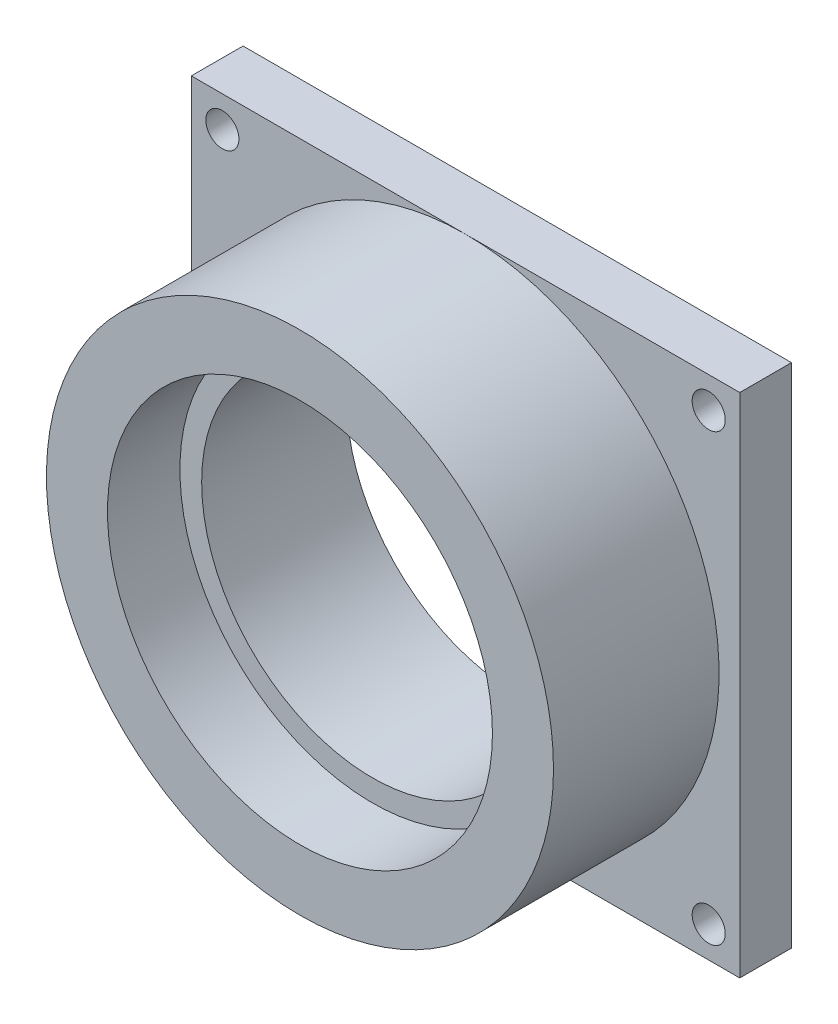
ISO-10303-21;
HEADER;
FILE_DESCRIPTION(('STEP AP214'),'2;1');
FILE_NAME('part.step','',(''),(''),'','','');
FILE_SCHEMA(('AUTOMOTIVE_DESIGN { 1 0 10303 214 1 1 1 1 }'));
ENDSEC;
DATA;
#1=APPLICATION_CONTEXT('core data for automotive mechanical design processes');
#2=APPLICATION_PROTOCOL_DEFINITION('international standard','automotive_design',2000,#1);
#3=PRODUCT_CONTEXT('',#1,'mechanical');
#4=PRODUCT('Part','Part','',(#3));
#5=PRODUCT_RELATED_PRODUCT_CATEGORY('part','',(#4));
#6=PRODUCT_DEFINITION_FORMATION('','',#4);
#7=PRODUCT_DEFINITION_CONTEXT('part definition',#1,'design');
#8=PRODUCT_DEFINITION('design','',#6,#7);
#9=PRODUCT_DEFINITION_SHAPE('','',#8);
#10=(LENGTH_UNIT() NAMED_UNIT(*) SI_UNIT(.MILLI.,.METRE.));
#11=(NAMED_UNIT(*) PLANE_ANGLE_UNIT() SI_UNIT($,.RADIAN.));
#12=(NAMED_UNIT(*) SI_UNIT($,.STERADIAN.) SOLID_ANGLE_UNIT());
#13=UNCERTAINTY_MEASURE_WITH_UNIT(LENGTH_MEASURE(1.E-05),#10,'distance_accuracy_value','');
#14=(GEOMETRIC_REPRESENTATION_CONTEXT(3) GLOBAL_UNCERTAINTY_ASSIGNED_CONTEXT((#13)) GLOBAL_UNIT_ASSIGNED_CONTEXT((#10,
#11,#12)) REPRESENTATION_CONTEXT('',''));
#15=CARTESIAN_POINT('',(0.,0.,0.));
#16=DIRECTION('',(0.,0.,1.));
#17=DIRECTION('',(1.,0.,0.));
#18=AXIS2_PLACEMENT_3D('',#15,#16,#17);
#19=CARTESIAN_POINT('',(0.,0.,5.));
#20=DIRECTION('',(0.,0.,-1.));
#21=DIRECTION('',(-1.,0.,0.));
#22=AXIS2_PLACEMENT_3D('',#19,#20,#21);
#23=PLANE('',#22);
#24=CARTESIAN_POINT('',(-23.4999999999999,21.5,5.));
#25=DIRECTION('',(0.,0.,-1.));
#26=DIRECTION('',(-1.,0.,0.));
#27=AXIS2_PLACEMENT_3D('',#24,#25,#26);
#28=CIRCLE('',#27,1.6);
#29=CARTESIAN_POINT('',(-25.0999999999999,21.5,5.));
#30=VERTEX_POINT('',#29);
#31=EDGE_CURVE('E164',#30,#30,#28,.T.);
#32=ORIENTED_EDGE('',*,*,#31,.T.);
#33=EDGE_LOOP('',(#32));
#34=FACE_BOUND('',#33,.T.);
#35=CARTESIAN_POINT('',(-23.5,-21.5,5.));
#36=DIRECTION('',(0.,0.,-1.));
#37=DIRECTION('',(-1.,0.,0.));
#38=AXIS2_PLACEMENT_3D('',#35,#36,#37);
#39=CIRCLE('',#38,1.6);
#40=CARTESIAN_POINT('',(-25.1,-21.5,5.));
#41=VERTEX_POINT('',#40);
#42=EDGE_CURVE('E165',#41,#41,#39,.T.);
#43=ORIENTED_EDGE('',*,*,#42,.T.);
#44=EDGE_LOOP('',(#43));
#45=FACE_BOUND('',#44,.T.);
#46=CARTESIAN_POINT('',(0.,0.,5.));
#47=DIRECTION('',(0.,0.,1.));
#48=DIRECTION('',(1.,0.,0.));
#49=AXIS2_PLACEMENT_3D('',#46,#47,#48);
#50=CIRCLE('',#49,24.5);
#51=CARTESIAN_POINT('',(0.,24.5,5.));
#52=VERTEX_POINT('',#51);
#53=CARTESIAN_POINT('',(0.,-24.5,5.));
#54=VERTEX_POINT('',#53);
#55=EDGE_CURVE('E56',#52,#54,#50,.T.);
#56=ORIENTED_EDGE('',*,*,#55,.F.);
#57=DIRECTION('',(-1.,0.,0.));
#58=VECTOR('',#57,1.);
#59=CARTESIAN_POINT('',(-26.5,24.5,5.));
#60=LINE('',#59,#58);
#61=CARTESIAN_POINT('',(-26.5,24.5,5.));
#62=VERTEX_POINT('',#61);
#63=EDGE_CURVE('E104',#52,#62,#60,.T.);
#64=ORIENTED_EDGE('',*,*,#63,.T.);
#65=DIRECTION('',(0.,-1.,0.));
#66=VECTOR('',#65,1.);
#67=CARTESIAN_POINT('',(-26.5,-24.5,5.));
#68=LINE('',#67,#66);
#69=CARTESIAN_POINT('',(-26.5,-24.5,5.));
#70=VERTEX_POINT('',#69);
#71=EDGE_CURVE('E103',#62,#70,#68,.T.);
#72=ORIENTED_EDGE('',*,*,#71,.T.);
#73=DIRECTION('',(1.,0.,0.));
#74=VECTOR('',#73,1.);
#75=CARTESIAN_POINT('',(-26.5,-24.5,5.));
#76=LINE('',#75,#74);
#77=EDGE_CURVE('E117',#70,#54,#76,.T.);
#78=ORIENTED_EDGE('',*,*,#77,.T.);
#79=EDGE_LOOP('',(#56,#64,#72,#78));
#80=FACE_BOUND('',#79,.T.);
#81=ADVANCED_FACE('F45',(#34,#45,#80),#23,.F.);
#82=CARTESIAN_POINT('',(26.5,-24.5,5.));
#83=DIRECTION('',(-1.,0.,0.));
#84=DIRECTION('',(0.,0.,1.));
#85=AXIS2_PLACEMENT_3D('',#82,#83,#84);
#86=PLANE('',#85);
#87=DIRECTION('',(0.,1.,0.));
#88=VECTOR('',#87,1.);
#89=CARTESIAN_POINT('',(26.5,-24.5,0.));
#90=LINE('',#89,#88);
#91=CARTESIAN_POINT('',(26.5,-24.5,0.));
#92=VERTEX_POINT('',#91);
#93=CARTESIAN_POINT('',(26.5,24.5,0.));
#94=VERTEX_POINT('',#93);
#95=EDGE_CURVE('E179',#92,#94,#90,.T.);
#96=ORIENTED_EDGE('',*,*,#95,.T.);
#97=DIRECTION('',(0.,0.,-1.));
#98=VECTOR('',#97,1.);
#99=CARTESIAN_POINT('',(26.5,24.5,5.));
#100=LINE('',#99,#98);
#101=CARTESIAN_POINT('',(26.5,24.5,5.));
#102=VERTEX_POINT('',#101);
#103=EDGE_CURVE('E49',#102,#94,#100,.T.);
#104=ORIENTED_EDGE('',*,*,#103,.F.);
#105=DIRECTION('',(0.,1.,0.));
#106=VECTOR('',#105,1.);
#107=CARTESIAN_POINT('',(26.5,-24.5,5.));
#108=LINE('',#107,#106);
#109=CARTESIAN_POINT('',(26.5,-24.5,5.));
#110=VERTEX_POINT('',#109);
#111=EDGE_CURVE('E100',#110,#102,#108,.T.);
#112=ORIENTED_EDGE('',*,*,#111,.F.);
#113=DIRECTION('',(0.,0.,-1.));
#114=VECTOR('',#113,1.);
#115=CARTESIAN_POINT('',(26.5,-24.5,5.));
#116=LINE('',#115,#114);
#117=EDGE_CURVE('E187',#110,#92,#116,.T.);
#118=ORIENTED_EDGE('',*,*,#117,.T.);
#119=EDGE_LOOP('',(#96,#104,#112,#118));
#120=FACE_BOUND('',#119,.T.);
#121=ADVANCED_FACE('F47',(#120),#86,.F.);
#122=CARTESIAN_POINT('',(-26.5,24.5,5.));
#123=DIRECTION('',(0.,-1.,0.));
#124=DIRECTION('',(0.,0.,-1.));
#125=AXIS2_PLACEMENT_3D('',#122,#123,#124);
#126=PLANE('',#125);
#127=DIRECTION('',(-1.,0.,0.));
#128=VECTOR('',#127,1.);
#129=CARTESIAN_POINT('',(-26.5,24.5,0.));
#130=LINE('',#129,#128);
#131=CARTESIAN_POINT('',(-26.5,24.5,0.));
#132=VERTEX_POINT('',#131);
#133=EDGE_CURVE('E191',#94,#132,#130,.T.);
#134=ORIENTED_EDGE('',*,*,#133,.T.);
#135=DIRECTION('',(0.,0.,-1.));
#136=VECTOR('',#135,1.);
#137=CARTESIAN_POINT('',(-26.5,24.5,5.));
#138=LINE('',#137,#136);
#139=EDGE_CURVE('E110',#62,#132,#138,.T.);
#140=ORIENTED_EDGE('',*,*,#139,.F.);
#141=ORIENTED_EDGE('',*,*,#63,.F.);
#142=EDGE_CURVE('E95',#102,#52,#60,.T.);
#143=ORIENTED_EDGE('',*,*,#142,.F.);
#144=ORIENTED_EDGE('',*,*,#103,.T.);
#145=EDGE_LOOP('',(#134,#140,#141,#143,#144));
#146=FACE_BOUND('',#145,.T.);
#147=ADVANCED_FACE('F108',(#146),#126,.F.);
#148=CARTESIAN_POINT('',(-26.5,-24.5,5.));
#149=DIRECTION('',(1.,0.,0.));
#150=DIRECTION('',(0.,0.,-1.));
#151=AXIS2_PLACEMENT_3D('',#148,#149,#150);
#152=PLANE('',#151);
#153=DIRECTION('',(0.,-1.,0.));
#154=VECTOR('',#153,1.);
#155=CARTESIAN_POINT('',(-26.5,-24.5,0.));
#156=LINE('',#155,#154);
#157=CARTESIAN_POINT('',(-26.5,-24.5,0.));
#158=VERTEX_POINT('',#157);
#159=EDGE_CURVE('E194',#132,#158,#156,.T.);
#160=ORIENTED_EDGE('',*,*,#159,.T.);
#161=DIRECTION('',(0.,0.,-1.));
#162=VECTOR('',#161,1.);
#163=CARTESIAN_POINT('',(-26.5,-24.5,5.));
#164=LINE('',#163,#162);
#165=EDGE_CURVE('E201',#70,#158,#164,.T.);
#166=ORIENTED_EDGE('',*,*,#165,.F.);
#167=ORIENTED_EDGE('',*,*,#71,.F.);
#168=ORIENTED_EDGE('',*,*,#139,.T.);
#169=EDGE_LOOP('',(#160,#166,#167,#168));
#170=FACE_BOUND('',#169,.T.);
#171=ADVANCED_FACE('F154',(#170),#152,.F.);
#172=CARTESIAN_POINT('',(-26.5,-24.5,5.));
#173=DIRECTION('',(0.,1.,0.));
#174=DIRECTION('',(0.,0.,1.));
#175=AXIS2_PLACEMENT_3D('',#172,#173,#174);
#176=PLANE('',#175);
#177=DIRECTION('',(1.,0.,0.));
#178=VECTOR('',#177,1.);
#179=CARTESIAN_POINT('',(-26.5,-24.5,0.));
#180=LINE('',#179,#178);
#181=EDGE_CURVE('E88',#158,#92,#180,.T.);
#182=ORIENTED_EDGE('',*,*,#181,.T.);
#183=ORIENTED_EDGE('',*,*,#117,.F.);
#184=EDGE_CURVE('E66',#54,#110,#76,.T.);
#185=ORIENTED_EDGE('',*,*,#184,.F.);
#186=ORIENTED_EDGE('',*,*,#77,.F.);
#187=ORIENTED_EDGE('',*,*,#165,.T.);
#188=EDGE_LOOP('',(#182,#183,#185,#186,#187));
#189=FACE_BOUND('',#188,.T.);
#190=ADVANCED_FACE('F149',(#189),#176,.F.);
#191=CARTESIAN_POINT('',(23.5,-21.5000000000003,5.));
#192=DIRECTION('',(0.,0.,-1.));
#193=DIRECTION('',(-1.,0.,0.));
#194=AXIS2_PLACEMENT_3D('',#191,#192,#193);
#195=CIRCLE('',#194,1.6);
#196=CARTESIAN_POINT('',(21.9,-21.5000000000003,5.));
#197=VERTEX_POINT('',#196);
#198=EDGE_CURVE('E121',#197,#197,#195,.T.);
#199=ORIENTED_EDGE('',*,*,#198,.T.);
#200=EDGE_LOOP('',(#199));
#201=FACE_BOUND('',#200,.T.);
#202=CARTESIAN_POINT('',(23.5000000000001,21.4999999999997,5.));
#203=DIRECTION('',(0.,0.,-1.));
#204=DIRECTION('',(-1.,0.,0.));
#205=AXIS2_PLACEMENT_3D('',#202,#203,#204);
#206=CIRCLE('',#205,1.6);
#207=CARTESIAN_POINT('',(21.9000000000001,21.4999999999997,5.));
#208=VERTEX_POINT('',#207);
#209=EDGE_CURVE('E161',#208,#208,#206,.T.);
#210=ORIENTED_EDGE('',*,*,#209,.T.);
#211=EDGE_LOOP('',(#210));
#212=FACE_BOUND('',#211,.T.);
#213=EDGE_CURVE('E11',#54,#52,#50,.T.);
#214=ORIENTED_EDGE('',*,*,#213,.F.);
#215=ORIENTED_EDGE('',*,*,#184,.T.);
#216=ORIENTED_EDGE('',*,*,#111,.T.);
#217=ORIENTED_EDGE('',*,*,#142,.T.);
#218=EDGE_LOOP('',(#214,#215,#216,#217));
#219=FACE_BOUND('',#218,.T.);
#220=ADVANCED_FACE('F98',(#201,#212,#219),#23,.F.);
#221=CARTESIAN_POINT('',(0.,0.,0.));
#222=DIRECTION('',(0.,0.,-1.));
#223=DIRECTION('',(-1.,0.,0.));
#224=AXIS2_PLACEMENT_3D('',#221,#222,#223);
#225=PLANE('',#224);
#226=CARTESIAN_POINT('',(0.,0.,0.));
#227=DIRECTION('',(0.,0.,1.));
#228=DIRECTION('',(1.,0.,0.));
#229=AXIS2_PLACEMENT_3D('',#226,#227,#228);
#230=CIRCLE('',#229,16.5);
#231=CARTESIAN_POINT('',(16.5,0.,0.));
#232=VERTEX_POINT('',#231);
#233=EDGE_CURVE('E326',#232,#232,#230,.T.);
#234=ORIENTED_EDGE('',*,*,#233,.T.);
#235=EDGE_LOOP('',(#234));
#236=FACE_BOUND('',#235,.T.);
#237=CARTESIAN_POINT('',(23.5,-21.5000000000003,0.));
#238=DIRECTION('',(0.,0.,-1.));
#239=DIRECTION('',(-1.,0.,0.));
#240=AXIS2_PLACEMENT_3D('',#237,#238,#239);
#241=CIRCLE('',#240,1.6);
#242=CARTESIAN_POINT('',(21.9,-21.5000000000003,0.));
#243=VERTEX_POINT('',#242);
#244=EDGE_CURVE('E348',#243,#243,#241,.T.);
#245=ORIENTED_EDGE('',*,*,#244,.F.);
#246=EDGE_LOOP('',(#245));
#247=FACE_BOUND('',#246,.T.);
#248=CARTESIAN_POINT('',(-23.4999999999999,21.5,0.));
#249=DIRECTION('',(0.,0.,-1.));
#250=DIRECTION('',(-1.,0.,0.));
#251=AXIS2_PLACEMENT_3D('',#248,#249,#250);
#252=CIRCLE('',#251,1.6);
#253=CARTESIAN_POINT('',(-25.0999999999999,21.5,0.));
#254=VERTEX_POINT('',#253);
#255=EDGE_CURVE('E347',#254,#254,#252,.T.);
#256=ORIENTED_EDGE('',*,*,#255,.F.);
#257=EDGE_LOOP('',(#256));
#258=FACE_BOUND('',#257,.T.);
#259=CARTESIAN_POINT('',(23.5000000000001,21.4999999999997,0.));
#260=DIRECTION('',(0.,0.,-1.));
#261=DIRECTION('',(-1.,0.,0.));
#262=AXIS2_PLACEMENT_3D('',#259,#260,#261);
#263=CIRCLE('',#262,1.6);
#264=CARTESIAN_POINT('',(21.9000000000001,21.4999999999997,0.));
#265=VERTEX_POINT('',#264);
#266=EDGE_CURVE('E340',#265,#265,#263,.T.);
#267=ORIENTED_EDGE('',*,*,#266,.F.);
#268=EDGE_LOOP('',(#267));
#269=FACE_BOUND('',#268,.T.);
#270=CARTESIAN_POINT('',(-23.5,-21.5,0.));
#271=DIRECTION('',(0.,0.,-1.));
#272=DIRECTION('',(-1.,0.,0.));
#273=AXIS2_PLACEMENT_3D('',#270,#271,#272);
#274=CIRCLE('',#273,1.6);
#275=CARTESIAN_POINT('',(-25.1,-21.5,0.));
#276=VERTEX_POINT('',#275);
#277=EDGE_CURVE('E171',#276,#276,#274,.T.);
#278=ORIENTED_EDGE('',*,*,#277,.F.);
#279=EDGE_LOOP('',(#278));
#280=FACE_BOUND('',#279,.T.);
#281=ORIENTED_EDGE('',*,*,#95,.F.);
#282=ORIENTED_EDGE('',*,*,#181,.F.);
#283=ORIENTED_EDGE('',*,*,#159,.F.);
#284=ORIENTED_EDGE('',*,*,#133,.F.);
#285=EDGE_LOOP('',(#281,#282,#283,#284));
#286=FACE_BOUND('',#285,.T.);
#287=ADVANCED_FACE('F125',(#236,#247,#258,#269,#280,#286),#225,.T.);
#288=CARTESIAN_POINT('',(0.,0.,21.));
#289=DIRECTION('',(0.,0.,-1.));
#290=DIRECTION('',(-1.,0.,0.));
#291=AXIS2_PLACEMENT_3D('',#288,#289,#290);
#292=CYLINDRICAL_SURFACE('',#291,24.5);
#293=CARTESIAN_POINT('',(0.,0.,21.));
#294=DIRECTION('',(0.,0.,1.));
#295=DIRECTION('',(1.,0.,0.));
#296=AXIS2_PLACEMENT_3D('',#293,#294,#295);
#297=CIRCLE('',#296,24.5);
#298=CARTESIAN_POINT('',(24.5,0.,21.));
#299=VERTEX_POINT('',#298);
#300=EDGE_CURVE('E120',#299,#299,#297,.T.);
#301=ORIENTED_EDGE('',*,*,#300,.F.);
#302=EDGE_LOOP('',(#301));
#303=FACE_BOUND('',#302,.T.);
#304=ORIENTED_EDGE('',*,*,#55,.T.);
#305=ORIENTED_EDGE('',*,*,#213,.T.);
#306=EDGE_LOOP('',(#304,#305));
#307=FACE_BOUND('',#306,.T.);
#308=ADVANCED_FACE('F122',(#303,#307),#292,.T.);
#309=CARTESIAN_POINT('',(0.,0.,21.));
#310=DIRECTION('',(0.,0.,1.));
#311=DIRECTION('',(1.,0.,0.));
#312=AXIS2_PLACEMENT_3D('',#309,#310,#311);
#313=PLANE('',#312);
#314=CARTESIAN_POINT('',(0.,0.,21.));
#315=DIRECTION('',(0.,0.,1.));
#316=DIRECTION('',(1.,0.,0.));
#317=AXIS2_PLACEMENT_3D('',#314,#315,#316);
#318=CIRCLE('',#317,18.6);
#319=CARTESIAN_POINT('',(18.6,0.,21.));
#320=VERTEX_POINT('',#319);
#321=EDGE_CURVE('E333',#320,#320,#318,.T.);
#322=ORIENTED_EDGE('',*,*,#321,.F.);
#323=EDGE_LOOP('',(#322));
#324=FACE_BOUND('',#323,.T.);
#325=ORIENTED_EDGE('',*,*,#300,.T.);
#326=EDGE_LOOP('',(#325));
#327=FACE_BOUND('',#326,.T.);
#328=ADVANCED_FACE('F124',(#324,#327),#313,.T.);
#329=CARTESIAN_POINT('',(-23.5,-21.5,21.));
#330=DIRECTION('',(0.,0.,-1.));
#331=DIRECTION('',(-1.,0.,0.));
#332=AXIS2_PLACEMENT_3D('',#329,#330,#331);
#333=CYLINDRICAL_SURFACE('',#332,1.6);
#334=ORIENTED_EDGE('',*,*,#277,.T.);
#335=EDGE_LOOP('',(#334));
#336=FACE_BOUND('',#335,.T.);
#337=ORIENTED_EDGE('',*,*,#42,.F.);
#338=EDGE_LOOP('',(#337));
#339=FACE_BOUND('',#338,.T.);
#340=ADVANCED_FACE('F133',(#336,#339),#333,.F.);
#341=CARTESIAN_POINT('',(23.5000000000001,21.4999999999997,21.));
#342=DIRECTION('',(0.,0.,-1.));
#343=DIRECTION('',(-1.,0.,0.));
#344=AXIS2_PLACEMENT_3D('',#341,#342,#343);
#345=CYLINDRICAL_SURFACE('',#344,1.6);
#346=ORIENTED_EDGE('',*,*,#266,.T.);
#347=EDGE_LOOP('',(#346));
#348=FACE_BOUND('',#347,.T.);
#349=ORIENTED_EDGE('',*,*,#209,.F.);
#350=EDGE_LOOP('',(#349));
#351=FACE_BOUND('',#350,.T.);
#352=ADVANCED_FACE('F263',(#348,#351),#345,.F.);
#353=CARTESIAN_POINT('',(-23.4999999999999,21.5,21.));
#354=DIRECTION('',(0.,0.,-1.));
#355=DIRECTION('',(-1.,0.,0.));
#356=AXIS2_PLACEMENT_3D('',#353,#354,#355);
#357=CYLINDRICAL_SURFACE('',#356,1.6);
#358=ORIENTED_EDGE('',*,*,#255,.T.);
#359=EDGE_LOOP('',(#358));
#360=FACE_BOUND('',#359,.T.);
#361=ORIENTED_EDGE('',*,*,#31,.F.);
#362=EDGE_LOOP('',(#361));
#363=FACE_BOUND('',#362,.T.);
#364=ADVANCED_FACE('F273',(#360,#363),#357,.F.);
#365=CARTESIAN_POINT('',(23.5,-21.5000000000003,21.));
#366=DIRECTION('',(0.,0.,-1.));
#367=DIRECTION('',(-1.,0.,0.));
#368=AXIS2_PLACEMENT_3D('',#365,#366,#367);
#369=CYLINDRICAL_SURFACE('',#368,1.6);
#370=ORIENTED_EDGE('',*,*,#244,.T.);
#371=EDGE_LOOP('',(#370));
#372=FACE_BOUND('',#371,.T.);
#373=ORIENTED_EDGE('',*,*,#198,.F.);
#374=EDGE_LOOP('',(#373));
#375=FACE_BOUND('',#374,.T.);
#376=ADVANCED_FACE('F283',(#372,#375),#369,.F.);
#377=CARTESIAN_POINT('',(0.,0.,14.));
#378=DIRECTION('',(0.,0.,1.));
#379=DIRECTION('',(1.,0.,0.));
#380=AXIS2_PLACEMENT_3D('',#377,#378,#379);
#381=CYLINDRICAL_SURFACE('',#380,18.6);
#382=CARTESIAN_POINT('',(0.,0.,14.));
#383=DIRECTION('',(0.,0.,1.));
#384=DIRECTION('',(1.,0.,0.));
#385=AXIS2_PLACEMENT_3D('',#382,#383,#384);
#386=CIRCLE('',#385,18.6);
#387=CARTESIAN_POINT('',(18.6,0.,14.));
#388=VERTEX_POINT('',#387);
#389=EDGE_CURVE('E336',#388,#388,#386,.T.);
#390=ORIENTED_EDGE('',*,*,#389,.F.);
#391=EDGE_LOOP('',(#390));
#392=FACE_BOUND('',#391,.T.);
#393=ORIENTED_EDGE('',*,*,#321,.T.);
#394=EDGE_LOOP('',(#393));
#395=FACE_BOUND('',#394,.T.);
#396=ADVANCED_FACE('F292',(#392,#395),#381,.F.);
#397=CARTESIAN_POINT('',(0.,0.,14.));
#398=DIRECTION('',(0.,0.,1.));
#399=DIRECTION('',(1.,0.,0.));
#400=AXIS2_PLACEMENT_3D('',#397,#398,#399);
#401=PLANE('',#400);
#402=CARTESIAN_POINT('',(0.,0.,14.));
#403=DIRECTION('',(0.,0.,1.));
#404=DIRECTION('',(1.,0.,0.));
#405=AXIS2_PLACEMENT_3D('',#402,#403,#404);
#406=CIRCLE('',#405,16.5);
#407=CARTESIAN_POINT('',(16.5,0.,14.));
#408=VERTEX_POINT('',#407);
#409=EDGE_CURVE('E329',#408,#408,#406,.T.);
#410=ORIENTED_EDGE('',*,*,#409,.F.);
#411=EDGE_LOOP('',(#410));
#412=FACE_BOUND('',#411,.T.);
#413=ORIENTED_EDGE('',*,*,#389,.T.);
#414=EDGE_LOOP('',(#413));
#415=FACE_BOUND('',#414,.T.);
#416=ADVANCED_FACE('F301',(#412,#415),#401,.T.);
#417=CARTESIAN_POINT('',(0.,0.,0.));
#418=DIRECTION('',(0.,0.,1.));
#419=DIRECTION('',(1.,0.,0.));
#420=AXIS2_PLACEMENT_3D('',#417,#418,#419);
#421=CYLINDRICAL_SURFACE('',#420,16.5);
#422=ORIENTED_EDGE('',*,*,#233,.F.);
#423=EDGE_LOOP('',(#422));
#424=FACE_BOUND('',#423,.T.);
#425=ORIENTED_EDGE('',*,*,#409,.T.);
#426=EDGE_LOOP('',(#425));
#427=FACE_BOUND('',#426,.T.);
#428=ADVANCED_FACE('F310',(#424,#427),#421,.F.);
#429=CLOSED_SHELL('',(#81,#121,#147,#171,#190,#220,#287,#308,#328,#340,#352,#364,#376,#396,#416,#428));
#430=MANIFOLD_SOLID_BREP('B2',#429);
#431=ADVANCED_BREP_SHAPE_REPRESENTATION('',(#18,#430),#14);
#432=SHAPE_DEFINITION_REPRESENTATION(#9,#431);
ENDSEC;
END-ISO-10303-21;
